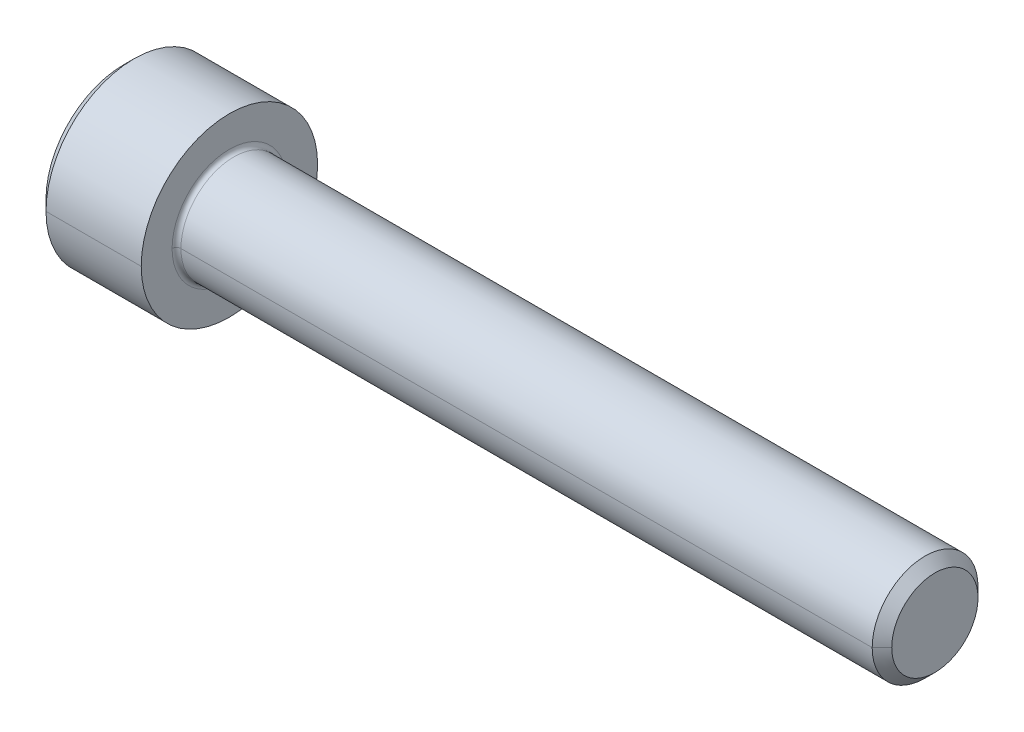
ISO-10303-21;
HEADER;
FILE_DESCRIPTION(('STEP AP214'),'2;1');
FILE_NAME('part.step','',(''),(''),'','','');
FILE_SCHEMA(('AUTOMOTIVE_DESIGN { 1 0 10303 214 1 1 1 1 }'));
ENDSEC;
DATA;
#1=APPLICATION_CONTEXT('core data for automotive mechanical design processes');
#2=APPLICATION_PROTOCOL_DEFINITION('international standard','automotive_design',2000,#1);
#3=PRODUCT_CONTEXT('',#1,'mechanical');
#4=PRODUCT('Part','Part','',(#3));
#5=PRODUCT_RELATED_PRODUCT_CATEGORY('part','',(#4));
#6=PRODUCT_DEFINITION_FORMATION('','',#4);
#7=PRODUCT_DEFINITION_CONTEXT('part definition',#1,'design');
#8=PRODUCT_DEFINITION('design','',#6,#7);
#9=PRODUCT_DEFINITION_SHAPE('','',#8);
#10=(LENGTH_UNIT() NAMED_UNIT(*) SI_UNIT(.MILLI.,.METRE.));
#11=(NAMED_UNIT(*) PLANE_ANGLE_UNIT() SI_UNIT($,.RADIAN.));
#12=(NAMED_UNIT(*) SI_UNIT($,.STERADIAN.) SOLID_ANGLE_UNIT());
#13=UNCERTAINTY_MEASURE_WITH_UNIT(LENGTH_MEASURE(1.E-05),#10,'distance_accuracy_value','');
#14=(GEOMETRIC_REPRESENTATION_CONTEXT(3) GLOBAL_UNCERTAINTY_ASSIGNED_CONTEXT((#13)) GLOBAL_UNIT_ASSIGNED_CONTEXT((#10,
#11,#12)) REPRESENTATION_CONTEXT('',''));
#15=CARTESIAN_POINT('',(0.,0.,0.));
#16=DIRECTION('',(0.,0.,1.));
#17=DIRECTION('',(1.,0.,0.));
#18=AXIS2_PLACEMENT_3D('',#15,#16,#17);
#19=CARTESIAN_POINT('',(3.,0.,0.));
#20=DIRECTION('',(-1.,0.,0.));
#21=DIRECTION('',(0.,0.,1.));
#22=AXIS2_PLACEMENT_3D('',#19,#20,#21);
#23=CONICAL_SURFACE('',#22,2.542,1.0471975511966);
#24=DIRECTION('',(-0.5,0.,-0.866025403784437));
#25=VECTOR('',#24,1.);
#26=CARTESIAN_POINT('',(3.,0.,-2.542));
#27=LINE('',#26,#25);
#28=CARTESIAN_POINT('',(4.46762438428004,0.,0.));
#29=VERTEX_POINT('',#28);
#30=CARTESIAN_POINT('',(3.,0.,-2.542));
#31=VERTEX_POINT('',#30);
#32=EDGE_CURVE('E166',#29,#31,#27,.T.);
#33=ORIENTED_EDGE('',*,*,#32,.F.);
#34=DIRECTION('',(-0.5,0.,0.866025403784437));
#35=VECTOR('',#34,1.);
#36=CARTESIAN_POINT('',(3.,0.,2.542));
#37=LINE('',#36,#35);
#38=CARTESIAN_POINT('',(3.,0.,2.542));
#39=VERTEX_POINT('',#38);
#40=EDGE_CURVE('E165',#29,#39,#37,.T.);
#41=ORIENTED_EDGE('',*,*,#40,.T.);
#42=CARTESIAN_POINT('',(3.,0.,0.));
#43=DIRECTION('',(-1.,0.,0.));
#44=DIRECTION('',(0.,0.,1.));
#45=AXIS2_PLACEMENT_3D('',#42,#43,#44);
#46=CIRCLE('',#45,2.542);
#47=CARTESIAN_POINT('',(3.,2.20143657642004,1.271));
#48=VERTEX_POINT('',#47);
#49=EDGE_CURVE('E19',#39,#48,#46,.T.);
#50=ORIENTED_EDGE('',*,*,#49,.T.);
#51=CARTESIAN_POINT('',(3.,0.,0.));
#52=DIRECTION('',(-1.,0.,0.));
#53=DIRECTION('',(0.,0.,1.));
#54=AXIS2_PLACEMENT_3D('',#51,#52,#53);
#55=CIRCLE('',#54,2.542);
#56=CARTESIAN_POINT('',(3.,2.20143657642004,-1.271));
#57=VERTEX_POINT('',#56);
#58=EDGE_CURVE('E25',#48,#57,#55,.T.);
#59=ORIENTED_EDGE('',*,*,#58,.T.);
#60=CARTESIAN_POINT('',(3.,0.,0.));
#61=DIRECTION('',(-1.,0.,0.));
#62=DIRECTION('',(0.,0.,1.));
#63=AXIS2_PLACEMENT_3D('',#60,#61,#62);
#64=CIRCLE('',#63,2.542);
#65=EDGE_CURVE('E11',#57,#31,#64,.T.);
#66=ORIENTED_EDGE('',*,*,#65,.T.);
#67=EDGE_LOOP('',(#33,#41,#50,#59,#66));
#68=FACE_BOUND('',#67,.T.);
#69=ADVANCED_FACE('F16',(#68),#23,.F.);
#70=CARTESIAN_POINT('',(3.,4.40287315284008,-2.542));
#71=DIRECTION('',(1.,0.,0.));
#72=DIRECTION('',(0.,1.,0.));
#73=AXIS2_PLACEMENT_3D('',#70,#71,#72);
#74=PLANE('',#73);
#75=DIRECTION('',(0.,-0.5,-0.866025403784438));
#76=VECTOR('',#75,1.);
#77=CARTESIAN_POINT('',(3.,2.93524876856006,0.));
#78=LINE('',#77,#76);
#79=CARTESIAN_POINT('',(3.,1.46762438428002,-2.542));
#80=VERTEX_POINT('',#79);
#81=EDGE_CURVE('E47',#57,#80,#78,.T.);
#82=ORIENTED_EDGE('',*,*,#81,.T.);
#83=DIRECTION('',(0.,-1.,0.));
#84=VECTOR('',#83,1.);
#85=CARTESIAN_POINT('',(3.,1.46762438428002,-2.542));
#86=LINE('',#85,#84);
#87=EDGE_CURVE('E232',#80,#31,#86,.T.);
#88=ORIENTED_EDGE('',*,*,#87,.T.);
#89=ORIENTED_EDGE('',*,*,#65,.F.);
#90=EDGE_LOOP('',(#82,#88,#89));
#91=FACE_BOUND('',#90,.T.);
#92=ADVANCED_FACE('F632',(#91),#74,.F.);
#93=CARTESIAN_POINT('',(3.,4.40287315284008,-2.542));
#94=DIRECTION('',(1.,0.,0.));
#95=DIRECTION('',(0.,1.,0.));
#96=AXIS2_PLACEMENT_3D('',#93,#94,#95);
#97=PLANE('',#96);
#98=DIRECTION('',(0.,-0.5,0.86602540378444));
#99=VECTOR('',#98,1.);
#100=CARTESIAN_POINT('',(3.,2.93524876856006,0.));
#101=LINE('',#100,#99);
#102=CARTESIAN_POINT('',(3.,2.93524876856006,0.));
#103=VERTEX_POINT('',#102);
#104=EDGE_CURVE('E300',#103,#48,#101,.T.);
#105=ORIENTED_EDGE('',*,*,#104,.F.);
#106=DIRECTION('',(0.,-0.5,-0.866025403784438));
#107=VECTOR('',#106,1.);
#108=CARTESIAN_POINT('',(3.,2.93524876856006,0.));
#109=LINE('',#108,#107);
#110=EDGE_CURVE('E281',#103,#57,#109,.T.);
#111=ORIENTED_EDGE('',*,*,#110,.T.);
#112=ORIENTED_EDGE('',*,*,#58,.F.);
#113=EDGE_LOOP('',(#105,#111,#112));
#114=FACE_BOUND('',#113,.T.);
#115=ADVANCED_FACE('F636',(#114),#97,.F.);
#116=CARTESIAN_POINT('',(3.,4.40287315284008,-2.542));
#117=DIRECTION('',(1.,0.,0.));
#118=DIRECTION('',(0.,1.,0.));
#119=AXIS2_PLACEMENT_3D('',#116,#117,#118);
#120=PLANE('',#119);
#121=DIRECTION('',(0.,1.,0.));
#122=VECTOR('',#121,1.);
#123=CARTESIAN_POINT('',(3.,-1.46762438428003,2.542));
#124=LINE('',#123,#122);
#125=CARTESIAN_POINT('',(3.,1.46762438428003,2.542));
#126=VERTEX_POINT('',#125);
#127=EDGE_CURVE('E268',#39,#126,#124,.T.);
#128=ORIENTED_EDGE('',*,*,#127,.T.);
#129=DIRECTION('',(0.,-0.5,0.86602540378444));
#130=VECTOR('',#129,1.);
#131=CARTESIAN_POINT('',(3.,2.93524876856006,0.));
#132=LINE('',#131,#130);
#133=EDGE_CURVE('E296',#48,#126,#132,.T.);
#134=ORIENTED_EDGE('',*,*,#133,.F.);
#135=ORIENTED_EDGE('',*,*,#49,.F.);
#136=EDGE_LOOP('',(#128,#134,#135));
#137=FACE_BOUND('',#136,.T.);
#138=ADVANCED_FACE('F562',(#137),#120,.F.);
#139=CARTESIAN_POINT('',(3.,4.40287315284008,-2.542));
#140=DIRECTION('',(1.,0.,0.));
#141=DIRECTION('',(0.,1.,0.));
#142=AXIS2_PLACEMENT_3D('',#139,#140,#141);
#143=PLANE('',#142);
#144=DIRECTION('',(0.,-0.5,-0.866025403784438));
#145=VECTOR('',#144,1.);
#146=CARTESIAN_POINT('',(3.,-1.46762438428003,2.542));
#147=LINE('',#146,#145);
#148=CARTESIAN_POINT('',(3.,-1.46762438428003,2.542));
#149=VERTEX_POINT('',#148);
#150=CARTESIAN_POINT('',(3.,-2.20143657642005,1.271));
#151=VERTEX_POINT('',#150);
#152=EDGE_CURVE('E153',#149,#151,#147,.T.);
#153=ORIENTED_EDGE('',*,*,#152,.F.);
#154=DIRECTION('',(0.,1.,0.));
#155=VECTOR('',#154,1.);
#156=CARTESIAN_POINT('',(3.,-1.46762438428003,2.542));
#157=LINE('',#156,#155);
#158=EDGE_CURVE('E251',#149,#39,#157,.T.);
#159=ORIENTED_EDGE('',*,*,#158,.T.);
#160=CARTESIAN_POINT('',(3.,0.,0.));
#161=DIRECTION('',(-1.,0.,0.));
#162=DIRECTION('',(0.,0.,1.));
#163=AXIS2_PLACEMENT_3D('',#160,#161,#162);
#164=CIRCLE('',#163,2.542);
#165=EDGE_CURVE('E185',#151,#39,#164,.T.);
#166=ORIENTED_EDGE('',*,*,#165,.F.);
#167=EDGE_LOOP('',(#153,#159,#166));
#168=FACE_BOUND('',#167,.T.);
#169=ADVANCED_FACE('F558',(#168),#143,.F.);
#170=CARTESIAN_POINT('',(3.,4.40287315284008,-2.542));
#171=DIRECTION('',(1.,0.,0.));
#172=DIRECTION('',(0.,1.,0.));
#173=AXIS2_PLACEMENT_3D('',#170,#171,#172);
#174=PLANE('',#173);
#175=DIRECTION('',(0.,0.5,-0.86602540378444));
#176=VECTOR('',#175,1.);
#177=CARTESIAN_POINT('',(3.,-2.93524876856006,0.));
#178=LINE('',#177,#176);
#179=CARTESIAN_POINT('',(3.,-2.93524876856006,0.));
#180=VERTEX_POINT('',#179);
#181=CARTESIAN_POINT('',(3.,-2.20143657642005,-1.271));
#182=VERTEX_POINT('',#181);
#183=EDGE_CURVE('E124',#180,#182,#178,.T.);
#184=ORIENTED_EDGE('',*,*,#183,.F.);
#185=DIRECTION('',(0.,-0.5,-0.866025403784438));
#186=VECTOR('',#185,1.);
#187=CARTESIAN_POINT('',(3.,-1.46762438428003,2.542));
#188=LINE('',#187,#186);
#189=EDGE_CURVE('E129',#151,#180,#188,.T.);
#190=ORIENTED_EDGE('',*,*,#189,.F.);
#191=CARTESIAN_POINT('',(3.,0.,0.));
#192=DIRECTION('',(-1.,0.,0.));
#193=DIRECTION('',(0.,0.,1.));
#194=AXIS2_PLACEMENT_3D('',#191,#192,#193);
#195=CIRCLE('',#194,2.542);
#196=EDGE_CURVE('E133',#182,#151,#195,.T.);
#197=ORIENTED_EDGE('',*,*,#196,.F.);
#198=EDGE_LOOP('',(#184,#190,#197));
#199=FACE_BOUND('',#198,.T.);
#200=ADVANCED_FACE('F126',(#199),#174,.F.);
#201=CARTESIAN_POINT('',(3.,4.40287315284008,-2.542));
#202=DIRECTION('',(1.,0.,0.));
#203=DIRECTION('',(0.,1.,0.));
#204=AXIS2_PLACEMENT_3D('',#201,#202,#203);
#205=PLANE('',#204);
#206=DIRECTION('',(0.,-1.,0.));
#207=VECTOR('',#206,1.);
#208=CARTESIAN_POINT('',(3.,1.46762438428002,-2.542));
#209=LINE('',#208,#207);
#210=CARTESIAN_POINT('',(3.,-1.46762438428004,-2.542));
#211=VERTEX_POINT('',#210);
#212=EDGE_CURVE('E259',#31,#211,#209,.T.);
#213=ORIENTED_EDGE('',*,*,#212,.T.);
#214=DIRECTION('',(0.,0.5,-0.86602540378444));
#215=VECTOR('',#214,1.);
#216=CARTESIAN_POINT('',(3.,-2.93524876856006,0.));
#217=LINE('',#216,#215);
#218=EDGE_CURVE('E138',#182,#211,#217,.T.);
#219=ORIENTED_EDGE('',*,*,#218,.F.);
#220=CARTESIAN_POINT('',(3.,0.,0.));
#221=DIRECTION('',(-1.,0.,0.));
#222=DIRECTION('',(0.,0.,1.));
#223=AXIS2_PLACEMENT_3D('',#220,#221,#222);
#224=CIRCLE('',#223,2.542);
#225=EDGE_CURVE('E170',#31,#182,#224,.T.);
#226=ORIENTED_EDGE('',*,*,#225,.F.);
#227=EDGE_LOOP('',(#213,#219,#226));
#228=FACE_BOUND('',#227,.T.);
#229=ADVANCED_FACE('F661',(#228),#205,.F.);
#230=CARTESIAN_POINT('',(3.,2.93524876856006,0.));
#231=DIRECTION('',(0.,0.866025403784438,-0.5));
#232=DIRECTION('',(-1.,0.,0.));
#233=AXIS2_PLACEMENT_3D('',#230,#231,#232);
#234=PLANE('',#233);
#235=DIRECTION('',(0.,-0.5,-0.866025403784438));
#236=VECTOR('',#235,1.);
#237=CARTESIAN_POINT('',(0.,2.93524876856006,0.));
#238=LINE('',#237,#236);
#239=CARTESIAN_POINT('',(0.,2.93524876856006,0.));
#240=VERTEX_POINT('',#239);
#241=CARTESIAN_POINT('',(0.,1.46762438428002,-2.542));
#242=VERTEX_POINT('',#241);
#243=EDGE_CURVE('E311',#240,#242,#238,.T.);
#244=ORIENTED_EDGE('',*,*,#243,.T.);
#245=DIRECTION('',(-1.,0.,0.));
#246=VECTOR('',#245,1.);
#247=CARTESIAN_POINT('',(3.,1.46762438428002,-2.542));
#248=LINE('',#247,#246);
#249=EDGE_CURVE('E229',#80,#242,#248,.T.);
#250=ORIENTED_EDGE('',*,*,#249,.F.);
#251=ORIENTED_EDGE('',*,*,#81,.F.);
#252=ORIENTED_EDGE('',*,*,#110,.F.);
#253=DIRECTION('',(-1.,0.,0.));
#254=VECTOR('',#253,1.);
#255=CARTESIAN_POINT('',(3.,2.93524876856006,0.));
#256=LINE('',#255,#254);
#257=EDGE_CURVE('E190',#103,#240,#256,.T.);
#258=ORIENTED_EDGE('',*,*,#257,.T.);
#259=EDGE_LOOP('',(#244,#250,#251,#252,#258));
#260=FACE_BOUND('',#259,.T.);
#261=ADVANCED_FACE('F652',(#260),#234,.F.);
#262=CARTESIAN_POINT('',(3.,1.46762438428002,-2.542));
#263=DIRECTION('',(0.,0.,-1.));
#264=DIRECTION('',(0.,-1.,0.));
#265=AXIS2_PLACEMENT_3D('',#262,#263,#264);
#266=PLANE('',#265);
#267=DIRECTION('',(0.,-1.,0.));
#268=VECTOR('',#267,1.);
#269=CARTESIAN_POINT('',(0.,1.46762438428002,-2.542));
#270=LINE('',#269,#268);
#271=CARTESIAN_POINT('',(0.,-1.46762438428004,-2.542));
#272=VERTEX_POINT('',#271);
#273=EDGE_CURVE('E305',#242,#272,#270,.T.);
#274=ORIENTED_EDGE('',*,*,#273,.T.);
#275=DIRECTION('',(-1.,0.,0.));
#276=VECTOR('',#275,1.);
#277=CARTESIAN_POINT('',(3.,-1.46762438428004,-2.542));
#278=LINE('',#277,#276);
#279=EDGE_CURVE('E256',#211,#272,#278,.T.);
#280=ORIENTED_EDGE('',*,*,#279,.F.);
#281=ORIENTED_EDGE('',*,*,#212,.F.);
#282=ORIENTED_EDGE('',*,*,#87,.F.);
#283=ORIENTED_EDGE('',*,*,#249,.T.);
#284=EDGE_LOOP('',(#274,#280,#281,#282,#283));
#285=FACE_BOUND('',#284,.T.);
#286=ADVANCED_FACE('F644',(#285),#266,.F.);
#287=CARTESIAN_POINT('',(3.,-2.93524876856006,0.));
#288=DIRECTION('',(0.,0.86602540378444,0.5));
#289=DIRECTION('',(1.,0.,0.));
#290=AXIS2_PLACEMENT_3D('',#287,#288,#289);
#291=PLANE('',#290);
#292=DIRECTION('',(0.,0.5,-0.86602540378444));
#293=VECTOR('',#292,1.);
#294=CARTESIAN_POINT('',(0.,-2.93524876856006,0.));
#295=LINE('',#294,#293);
#296=CARTESIAN_POINT('',(0.,-2.93524876856006,0.));
#297=VERTEX_POINT('',#296);
#298=EDGE_CURVE('E145',#297,#272,#295,.T.);
#299=ORIENTED_EDGE('',*,*,#298,.F.);
#300=DIRECTION('',(-1.,0.,0.));
#301=VECTOR('',#300,1.);
#302=CARTESIAN_POINT('',(3.,-2.93524876856006,0.));
#303=LINE('',#302,#301);
#304=EDGE_CURVE('E139',#180,#297,#303,.T.);
#305=ORIENTED_EDGE('',*,*,#304,.F.);
#306=ORIENTED_EDGE('',*,*,#183,.T.);
#307=ORIENTED_EDGE('',*,*,#218,.T.);
#308=ORIENTED_EDGE('',*,*,#279,.T.);
#309=EDGE_LOOP('',(#299,#305,#306,#307,#308));
#310=FACE_BOUND('',#309,.T.);
#311=ADVANCED_FACE('F142',(#310),#291,.T.);
#312=CARTESIAN_POINT('',(3.,-1.46762438428003,2.542));
#313=DIRECTION('',(0.,0.866025403784438,-0.5));
#314=DIRECTION('',(-1.,0.,0.));
#315=AXIS2_PLACEMENT_3D('',#312,#313,#314);
#316=PLANE('',#315);
#317=DIRECTION('',(0.,-0.5,-0.866025403784438));
#318=VECTOR('',#317,1.);
#319=CARTESIAN_POINT('',(0.,-1.46762438428003,2.542));
#320=LINE('',#319,#318);
#321=CARTESIAN_POINT('',(0.,-1.46762438428003,2.542));
#322=VERTEX_POINT('',#321);
#323=EDGE_CURVE('E295',#322,#297,#320,.T.);
#324=ORIENTED_EDGE('',*,*,#323,.F.);
#325=DIRECTION('',(-1.,0.,0.));
#326=VECTOR('',#325,1.);
#327=CARTESIAN_POINT('',(3.,-1.46762438428003,2.542));
#328=LINE('',#327,#326);
#329=EDGE_CURVE('E161',#149,#322,#328,.T.);
#330=ORIENTED_EDGE('',*,*,#329,.F.);
#331=ORIENTED_EDGE('',*,*,#152,.T.);
#332=ORIENTED_EDGE('',*,*,#189,.T.);
#333=ORIENTED_EDGE('',*,*,#304,.T.);
#334=EDGE_LOOP('',(#324,#330,#331,#332,#333));
#335=FACE_BOUND('',#334,.T.);
#336=ADVANCED_FACE('F151',(#335),#316,.T.);
#337=CARTESIAN_POINT('',(3.,-1.46762438428003,2.542));
#338=DIRECTION('',(0.,0.,1.));
#339=DIRECTION('',(0.,-1.,0.));
#340=AXIS2_PLACEMENT_3D('',#337,#338,#339);
#341=PLANE('',#340);
#342=DIRECTION('',(0.,1.,0.));
#343=VECTOR('',#342,1.);
#344=CARTESIAN_POINT('',(0.,-1.46762438428003,2.542));
#345=LINE('',#344,#343);
#346=CARTESIAN_POINT('',(0.,1.46762438428003,2.542));
#347=VERTEX_POINT('',#346);
#348=EDGE_CURVE('E291',#322,#347,#345,.T.);
#349=ORIENTED_EDGE('',*,*,#348,.T.);
#350=DIRECTION('',(-1.,0.,0.));
#351=VECTOR('',#350,1.);
#352=CARTESIAN_POINT('',(3.,1.46762438428003,2.542));
#353=LINE('',#352,#351);
#354=EDGE_CURVE('E271',#126,#347,#353,.T.);
#355=ORIENTED_EDGE('',*,*,#354,.F.);
#356=ORIENTED_EDGE('',*,*,#127,.F.);
#357=ORIENTED_EDGE('',*,*,#158,.F.);
#358=ORIENTED_EDGE('',*,*,#329,.T.);
#359=EDGE_LOOP('',(#349,#355,#356,#357,#358));
#360=FACE_BOUND('',#359,.T.);
#361=ADVANCED_FACE('F611',(#360),#341,.F.);
#362=CARTESIAN_POINT('',(3.,2.93524876856006,0.));
#363=DIRECTION('',(0.,-0.86602540378444,-0.5));
#364=DIRECTION('',(0.,0.5,-0.86602540378444));
#365=AXIS2_PLACEMENT_3D('',#362,#363,#364);
#366=PLANE('',#365);
#367=DIRECTION('',(0.,-0.5,0.86602540378444));
#368=VECTOR('',#367,1.);
#369=CARTESIAN_POINT('',(0.,2.93524876856006,0.));
#370=LINE('',#369,#368);
#371=EDGE_CURVE('E280',#240,#347,#370,.T.);
#372=ORIENTED_EDGE('',*,*,#371,.F.);
#373=ORIENTED_EDGE('',*,*,#257,.F.);
#374=ORIENTED_EDGE('',*,*,#104,.T.);
#375=ORIENTED_EDGE('',*,*,#133,.T.);
#376=ORIENTED_EDGE('',*,*,#354,.T.);
#377=EDGE_LOOP('',(#372,#373,#374,#375,#376));
#378=FACE_BOUND('',#377,.T.);
#379=ADVANCED_FACE('F486',(#378),#366,.T.);
#380=CARTESIAN_POINT('',(6.25,0.,0.));
#381=DIRECTION('',(1.,0.,0.));
#382=DIRECTION('',(0.,0.,-1.));
#383=AXIS2_PLACEMENT_3D('',#380,#381,#382);
#384=TOROIDAL_SURFACE('',#383,3.25,0.25);
#385=CARTESIAN_POINT('',(6.25,0.,3.25));
#386=DIRECTION('',(0.,1.,0.));
#387=DIRECTION('',(0.,0.,1.));
#388=AXIS2_PLACEMENT_3D('',#385,#386,#387);
#389=CIRCLE('',#388,0.25);
#390=CARTESIAN_POINT('',(6.25,0.,3.));
#391=VERTEX_POINT('',#390);
#392=CARTESIAN_POINT('',(6.,0.,3.25));
#393=VERTEX_POINT('',#392);
#394=EDGE_CURVE('E202',#391,#393,#389,.T.);
#395=ORIENTED_EDGE('',*,*,#394,.F.);
#396=CARTESIAN_POINT('',(6.25,0.,0.));
#397=DIRECTION('',(1.,0.,0.));
#398=DIRECTION('',(0.,0.,-1.));
#399=AXIS2_PLACEMENT_3D('',#396,#397,#398);
#400=CIRCLE('',#399,3.);
#401=CARTESIAN_POINT('',(6.25,0.,-3.));
#402=VERTEX_POINT('',#401);
#403=EDGE_CURVE('E177',#402,#391,#400,.T.);
#404=ORIENTED_EDGE('',*,*,#403,.F.);
#405=CARTESIAN_POINT('',(6.25,0.,-3.25));
#406=DIRECTION('',(0.,-1.,0.));
#407=DIRECTION('',(0.,0.,-1.));
#408=AXIS2_PLACEMENT_3D('',#405,#406,#407);
#409=CIRCLE('',#408,0.25);
#410=CARTESIAN_POINT('',(6.,0.,-3.25));
#411=VERTEX_POINT('',#410);
#412=EDGE_CURVE('E219',#402,#411,#409,.T.);
#413=ORIENTED_EDGE('',*,*,#412,.T.);
#414=CARTESIAN_POINT('',(6.,0.,0.));
#415=DIRECTION('',(-1.,0.,0.));
#416=DIRECTION('',(0.,0.,-1.));
#417=AXIS2_PLACEMENT_3D('',#414,#415,#416);
#418=CIRCLE('',#417,3.25);
#419=EDGE_CURVE('E272',#393,#411,#418,.T.);
#420=ORIENTED_EDGE('',*,*,#419,.F.);
#421=EDGE_LOOP('',(#395,#404,#413,#420));
#422=FACE_BOUND('',#421,.T.);
#423=ADVANCED_FACE('F481',(#422),#384,.F.);
#424=CARTESIAN_POINT('',(46.,2.4455,0.));
#425=DIRECTION('',(1.,0.,0.));
#426=DIRECTION('',(0.,1.,0.));
#427=AXIS2_PLACEMENT_3D('',#424,#425,#426);
#428=PLANE('',#427);
#429=CARTESIAN_POINT('',(46.,0.,0.));
#430=DIRECTION('',(-1.,0.,0.));
#431=DIRECTION('',(0.,0.,1.));
#432=AXIS2_PLACEMENT_3D('',#429,#430,#431);
#433=CIRCLE('',#432,2.4455);
#434=CARTESIAN_POINT('',(46.,0.,2.4455));
#435=VERTEX_POINT('',#434);
#436=CARTESIAN_POINT('',(46.,0.,-2.4455));
#437=VERTEX_POINT('',#436);
#438=EDGE_CURVE('E215',#435,#437,#433,.T.);
#439=ORIENTED_EDGE('',*,*,#438,.F.);
#440=CARTESIAN_POINT('',(46.,0.,0.));
#441=DIRECTION('',(-1.,0.,0.));
#442=DIRECTION('',(0.,0.,1.));
#443=AXIS2_PLACEMENT_3D('',#440,#441,#442);
#444=CIRCLE('',#443,2.4455);
#445=EDGE_CURVE('E187',#437,#435,#444,.T.);
#446=ORIENTED_EDGE('',*,*,#445,.F.);
#447=EDGE_LOOP('',(#439,#446));
#448=FACE_BOUND('',#447,.T.);
#449=ADVANCED_FACE('F485',(#448),#428,.T.);
#450=CARTESIAN_POINT('',(46.,0.,0.));
#451=DIRECTION('',(-1.,0.,0.));
#452=DIRECTION('',(0.,0.,1.));
#453=AXIS2_PLACEMENT_3D('',#450,#451,#452);
#454=CONICAL_SURFACE('',#453,2.4455,0.785398163397383);
#455=DIRECTION('',(-0.707106781186594,0.,-0.707106781186501));
#456=VECTOR('',#455,1.);
#457=CARTESIAN_POINT('',(46.,0.,-2.4455));
#458=LINE('',#457,#456);
#459=CARTESIAN_POINT('',(45.4455,0.,-2.99999999999996));
#460=VERTEX_POINT('',#459);
#461=EDGE_CURVE('E207',#437,#460,#458,.T.);
#462=ORIENTED_EDGE('',*,*,#461,.F.);
#463=ORIENTED_EDGE('',*,*,#445,.T.);
#464=DIRECTION('',(-0.707106781186594,0.,0.707106781186501));
#465=VECTOR('',#464,1.);
#466=CARTESIAN_POINT('',(46.,0.,2.4455));
#467=LINE('',#466,#465);
#468=CARTESIAN_POINT('',(45.4455,0.,2.99999999999996));
#469=VERTEX_POINT('',#468);
#470=EDGE_CURVE('E178',#435,#469,#467,.T.);
#471=ORIENTED_EDGE('',*,*,#470,.T.);
#472=CARTESIAN_POINT('',(45.4455,0.,0.));
#473=DIRECTION('',(-1.,0.,0.));
#474=DIRECTION('',(0.,0.,1.));
#475=AXIS2_PLACEMENT_3D('',#472,#473,#474);
#476=CIRCLE('',#475,2.99999999999996);
#477=EDGE_CURVE('E191',#460,#469,#476,.T.);
#478=ORIENTED_EDGE('',*,*,#477,.F.);
#479=EDGE_LOOP('',(#462,#463,#471,#478));
#480=FACE_BOUND('',#479,.T.);
#481=ADVANCED_FACE('F543',(#480),#454,.T.);
#482=CARTESIAN_POINT('',(-31.75,0.,0.));
#483=DIRECTION('',(-1.,0.,0.));
#484=DIRECTION('',(0.,0.,1.));
#485=AXIS2_PLACEMENT_3D('',#482,#483,#484);
#486=CYLINDRICAL_SURFACE('',#485,3.);
#487=DIRECTION('',(-1.,0.,0.));
#488=VECTOR('',#487,1.);
#489=CARTESIAN_POINT('',(-31.75,0.,-3.));
#490=LINE('',#489,#488);
#491=EDGE_CURVE('E173',#460,#402,#490,.T.);
#492=ORIENTED_EDGE('',*,*,#491,.F.);
#493=ORIENTED_EDGE('',*,*,#477,.T.);
#494=DIRECTION('',(-1.,0.,0.));
#495=VECTOR('',#494,1.);
#496=CARTESIAN_POINT('',(-31.75,0.,3.));
#497=LINE('',#496,#495);
#498=EDGE_CURVE('E179',#469,#391,#497,.T.);
#499=ORIENTED_EDGE('',*,*,#498,.T.);
#500=CARTESIAN_POINT('',(6.25,0.,0.));
#501=DIRECTION('',(1.,0.,0.));
#502=DIRECTION('',(0.,0.,-1.));
#503=AXIS2_PLACEMENT_3D('',#500,#501,#502);
#504=CIRCLE('',#503,3.);
#505=EDGE_CURVE('E197',#391,#402,#504,.T.);
#506=ORIENTED_EDGE('',*,*,#505,.T.);
#507=EDGE_LOOP('',(#492,#493,#499,#506));
#508=FACE_BOUND('',#507,.T.);
#509=ADVANCED_FACE('F497',(#508),#486,.T.);
#510=CARTESIAN_POINT('',(6.,5.,0.));
#511=DIRECTION('',(1.,0.,0.));
#512=DIRECTION('',(0.,1.,0.));
#513=AXIS2_PLACEMENT_3D('',#510,#511,#512);
#514=PLANE('',#513);
#515=CARTESIAN_POINT('',(6.,0.,0.));
#516=DIRECTION('',(-1.,0.,0.));
#517=DIRECTION('',(0.,0.,-1.));
#518=AXIS2_PLACEMENT_3D('',#515,#516,#517);
#519=CIRCLE('',#518,3.25);
#520=EDGE_CURVE('E211',#411,#393,#519,.T.);
#521=ORIENTED_EDGE('',*,*,#520,.T.);
#522=ORIENTED_EDGE('',*,*,#419,.T.);
#523=EDGE_LOOP('',(#521,#522));
#524=FACE_BOUND('',#523,.T.);
#525=CARTESIAN_POINT('',(6.,0.,0.));
#526=DIRECTION('',(-1.,0.,0.));
#527=DIRECTION('',(0.,0.,1.));
#528=AXIS2_PLACEMENT_3D('',#525,#526,#527);
#529=CIRCLE('',#528,5.);
#530=CARTESIAN_POINT('',(6.,0.,5.));
#531=VERTEX_POINT('',#530);
#532=CARTESIAN_POINT('',(6.,0.,-5.));
#533=VERTEX_POINT('',#532);
#534=EDGE_CURVE('E183',#531,#533,#529,.T.);
#535=ORIENTED_EDGE('',*,*,#534,.F.);
#536=CARTESIAN_POINT('',(6.,0.,0.));
#537=DIRECTION('',(-1.,0.,0.));
#538=DIRECTION('',(0.,0.,1.));
#539=AXIS2_PLACEMENT_3D('',#536,#537,#538);
#540=CIRCLE('',#539,5.);
#541=EDGE_CURVE('E276',#533,#531,#540,.T.);
#542=ORIENTED_EDGE('',*,*,#541,.F.);
#543=EDGE_LOOP('',(#535,#542));
#544=FACE_BOUND('',#543,.T.);
#545=ADVANCED_FACE('F492',(#524,#544),#514,.T.);
#546=CARTESIAN_POINT('',(-31.75,0.,0.));
#547=DIRECTION('',(-1.,0.,0.));
#548=DIRECTION('',(0.,0.,1.));
#549=AXIS2_PLACEMENT_3D('',#546,#547,#548);
#550=CYLINDRICAL_SURFACE('',#549,5.);
#551=DIRECTION('',(-1.,0.,0.));
#552=VECTOR('',#551,1.);
#553=CARTESIAN_POINT('',(-31.75,0.,-5.));
#554=LINE('',#553,#552);
#555=CARTESIAN_POINT('',(0.6,0.,-5.));
#556=VERTEX_POINT('',#555);
#557=EDGE_CURVE('E236',#533,#556,#554,.T.);
#558=ORIENTED_EDGE('',*,*,#557,.F.);
#559=ORIENTED_EDGE('',*,*,#541,.T.);
#560=DIRECTION('',(-1.,0.,0.));
#561=VECTOR('',#560,1.);
#562=CARTESIAN_POINT('',(-31.75,0.,5.));
#563=LINE('',#562,#561);
#564=CARTESIAN_POINT('',(0.6,0.,5.));
#565=VERTEX_POINT('',#564);
#566=EDGE_CURVE('E244',#531,#565,#563,.T.);
#567=ORIENTED_EDGE('',*,*,#566,.T.);
#568=CARTESIAN_POINT('',(0.6,0.,0.));
#569=DIRECTION('',(-1.,0.,0.));
#570=DIRECTION('',(0.,0.,1.));
#571=AXIS2_PLACEMENT_3D('',#568,#569,#570);
#572=CIRCLE('',#571,5.);
#573=EDGE_CURVE('E317',#556,#565,#572,.T.);
#574=ORIENTED_EDGE('',*,*,#573,.F.);
#575=EDGE_LOOP('',(#558,#559,#567,#574));
#576=FACE_BOUND('',#575,.T.);
#577=ADVANCED_FACE('F496',(#576),#550,.T.);
#578=CARTESIAN_POINT('',(0.,0.,0.));
#579=DIRECTION('',(1.,0.,0.));
#580=DIRECTION('',(0.,0.,-1.));
#581=AXIS2_PLACEMENT_3D('',#578,#579,#580);
#582=CONICAL_SURFACE('',#581,4.4,0.785398163397442);
#583=DIRECTION('',(0.707106781186552,0.,0.707106781186543));
#584=VECTOR('',#583,1.);
#585=CARTESIAN_POINT('',(0.,0.,4.4));
#586=LINE('',#585,#584);
#587=CARTESIAN_POINT('',(0.,0.,4.4));
#588=VERTEX_POINT('',#587);
#589=EDGE_CURVE('E255',#588,#565,#586,.T.);
#590=ORIENTED_EDGE('',*,*,#589,.F.);
#591=CARTESIAN_POINT('',(0.,0.,0.));
#592=DIRECTION('',(-1.,0.,0.));
#593=DIRECTION('',(0.,0.,1.));
#594=AXIS2_PLACEMENT_3D('',#591,#592,#593);
#595=CIRCLE('',#594,4.4);
#596=CARTESIAN_POINT('',(0.,0.,-4.4));
#597=VERTEX_POINT('',#596);
#598=EDGE_CURVE('E267',#597,#588,#595,.T.);
#599=ORIENTED_EDGE('',*,*,#598,.F.);
#600=DIRECTION('',(0.707106781186552,0.,-0.707106781186543));
#601=VECTOR('',#600,1.);
#602=CARTESIAN_POINT('',(0.,0.,-4.4));
#603=LINE('',#602,#601);
#604=EDGE_CURVE('E263',#597,#556,#603,.T.);
#605=ORIENTED_EDGE('',*,*,#604,.T.);
#606=ORIENTED_EDGE('',*,*,#573,.T.);
#607=EDGE_LOOP('',(#590,#599,#605,#606));
#608=FACE_BOUND('',#607,.T.);
#609=ADVANCED_FACE('F503',(#608),#582,.T.);
#610=CARTESIAN_POINT('',(0.,0.,0.));
#611=DIRECTION('',(-1.,0.,0.));
#612=DIRECTION('',(0.,0.,1.));
#613=AXIS2_PLACEMENT_3D('',#610,#611,#612);
#614=PLANE('',#613);
#615=ORIENTED_EDGE('',*,*,#371,.T.);
#616=ORIENTED_EDGE('',*,*,#348,.F.);
#617=ORIENTED_EDGE('',*,*,#323,.T.);
#618=ORIENTED_EDGE('',*,*,#298,.T.);
#619=ORIENTED_EDGE('',*,*,#273,.F.);
#620=ORIENTED_EDGE('',*,*,#243,.F.);
#621=EDGE_LOOP('',(#615,#616,#617,#618,#619,#620));
#622=FACE_BOUND('',#621,.T.);
#623=ORIENTED_EDGE('',*,*,#598,.T.);
#624=CARTESIAN_POINT('',(0.,0.,0.));
#625=DIRECTION('',(-1.,0.,0.));
#626=DIRECTION('',(0.,0.,1.));
#627=AXIS2_PLACEMENT_3D('',#624,#625,#626);
#628=CIRCLE('',#627,4.4);
#629=EDGE_CURVE('E248',#588,#597,#628,.T.);
#630=ORIENTED_EDGE('',*,*,#629,.T.);
#631=EDGE_LOOP('',(#623,#630));
#632=FACE_BOUND('',#631,.T.);
#633=ADVANCED_FACE('F507',(#622,#632),#614,.T.);
#634=CARTESIAN_POINT('',(0.,0.,0.));
#635=DIRECTION('',(1.,0.,0.));
#636=DIRECTION('',(0.,0.,-1.));
#637=AXIS2_PLACEMENT_3D('',#634,#635,#636);
#638=CONICAL_SURFACE('',#637,4.4,0.785398163397442);
#639=ORIENTED_EDGE('',*,*,#629,.F.);
#640=ORIENTED_EDGE('',*,*,#589,.T.);
#641=CARTESIAN_POINT('',(0.6,0.,0.));
#642=DIRECTION('',(-1.,0.,0.));
#643=DIRECTION('',(0.,0.,1.));
#644=AXIS2_PLACEMENT_3D('',#641,#642,#643);
#645=CIRCLE('',#644,5.);
#646=EDGE_CURVE('E240',#565,#556,#645,.T.);
#647=ORIENTED_EDGE('',*,*,#646,.T.);
#648=ORIENTED_EDGE('',*,*,#604,.F.);
#649=EDGE_LOOP('',(#639,#640,#647,#648));
#650=FACE_BOUND('',#649,.T.);
#651=ADVANCED_FACE('F552',(#650),#638,.T.);
#652=CARTESIAN_POINT('',(-31.75,0.,0.));
#653=DIRECTION('',(-1.,0.,0.));
#654=DIRECTION('',(0.,0.,1.));
#655=AXIS2_PLACEMENT_3D('',#652,#653,#654);
#656=CYLINDRICAL_SURFACE('',#655,5.);
#657=ORIENTED_EDGE('',*,*,#534,.T.);
#658=ORIENTED_EDGE('',*,*,#557,.T.);
#659=ORIENTED_EDGE('',*,*,#646,.F.);
#660=ORIENTED_EDGE('',*,*,#566,.F.);
#661=EDGE_LOOP('',(#657,#658,#659,#660));
#662=FACE_BOUND('',#661,.T.);
#663=ADVANCED_FACE('F534',(#662),#656,.T.);
#664=CARTESIAN_POINT('',(-31.75,0.,0.));
#665=DIRECTION('',(-1.,0.,0.));
#666=DIRECTION('',(0.,0.,1.));
#667=AXIS2_PLACEMENT_3D('',#664,#665,#666);
#668=CYLINDRICAL_SURFACE('',#667,3.);
#669=CARTESIAN_POINT('',(45.4455,0.,0.));
#670=DIRECTION('',(-1.,0.,0.));
#671=DIRECTION('',(0.,0.,1.));
#672=AXIS2_PLACEMENT_3D('',#669,#670,#671);
#673=CIRCLE('',#672,2.99999999999996);
#674=EDGE_CURVE('E203',#469,#460,#673,.T.);
#675=ORIENTED_EDGE('',*,*,#674,.T.);
#676=ORIENTED_EDGE('',*,*,#491,.T.);
#677=ORIENTED_EDGE('',*,*,#403,.T.);
#678=ORIENTED_EDGE('',*,*,#498,.F.);
#679=EDGE_LOOP('',(#675,#676,#677,#678));
#680=FACE_BOUND('',#679,.T.);
#681=ADVANCED_FACE('F525',(#680),#668,.T.);
#682=CARTESIAN_POINT('',(46.,0.,0.));
#683=DIRECTION('',(-1.,0.,0.));
#684=DIRECTION('',(0.,0.,1.));
#685=AXIS2_PLACEMENT_3D('',#682,#683,#684);
#686=CONICAL_SURFACE('',#685,2.4455,0.785398163397383);
#687=ORIENTED_EDGE('',*,*,#438,.T.);
#688=ORIENTED_EDGE('',*,*,#461,.T.);
#689=ORIENTED_EDGE('',*,*,#674,.F.);
#690=ORIENTED_EDGE('',*,*,#470,.F.);
#691=EDGE_LOOP('',(#687,#688,#689,#690));
#692=FACE_BOUND('',#691,.T.);
#693=ADVANCED_FACE('F516',(#692),#686,.T.);
#694=CARTESIAN_POINT('',(6.25,0.,0.));
#695=DIRECTION('',(1.,0.,0.));
#696=DIRECTION('',(0.,0.,-1.));
#697=AXIS2_PLACEMENT_3D('',#694,#695,#696);
#698=TOROIDAL_SURFACE('',#697,3.25,0.25);
#699=ORIENTED_EDGE('',*,*,#505,.F.);
#700=ORIENTED_EDGE('',*,*,#394,.T.);
#701=ORIENTED_EDGE('',*,*,#520,.F.);
#702=ORIENTED_EDGE('',*,*,#412,.F.);
#703=EDGE_LOOP('',(#699,#700,#701,#702));
#704=FACE_BOUND('',#703,.T.);
#705=ADVANCED_FACE('F475',(#704),#698,.F.);
#706=CARTESIAN_POINT('',(3.,0.,0.));
#707=DIRECTION('',(-1.,0.,0.));
#708=DIRECTION('',(0.,0.,1.));
#709=AXIS2_PLACEMENT_3D('',#706,#707,#708);
#710=CONICAL_SURFACE('',#709,2.542,1.0471975511966);
#711=ORIENTED_EDGE('',*,*,#40,.F.);
#712=ORIENTED_EDGE('',*,*,#32,.T.);
#713=ORIENTED_EDGE('',*,*,#225,.T.);
#714=ORIENTED_EDGE('',*,*,#196,.T.);
#715=ORIENTED_EDGE('',*,*,#165,.T.);
#716=EDGE_LOOP('',(#711,#712,#713,#714,#715));
#717=FACE_BOUND('',#716,.T.);
#718=ADVANCED_FACE('F471',(#717),#710,.F.);
#719=CLOSED_SHELL('',(#69,#92,#115,#138,#169,#200,#229,#261,#286,#311,#336,#361,#379,#423,#449,
#481,#509,#545,#577,#609,#633,#651,#663,#681,#693,#705,#718));
#720=MANIFOLD_SOLID_BREP('B1',#719);
#721=ADVANCED_BREP_SHAPE_REPRESENTATION('',(#18,#720),#14);
#722=SHAPE_DEFINITION_REPRESENTATION(#9,#721);
ENDSEC;
END-ISO-10303-21;
